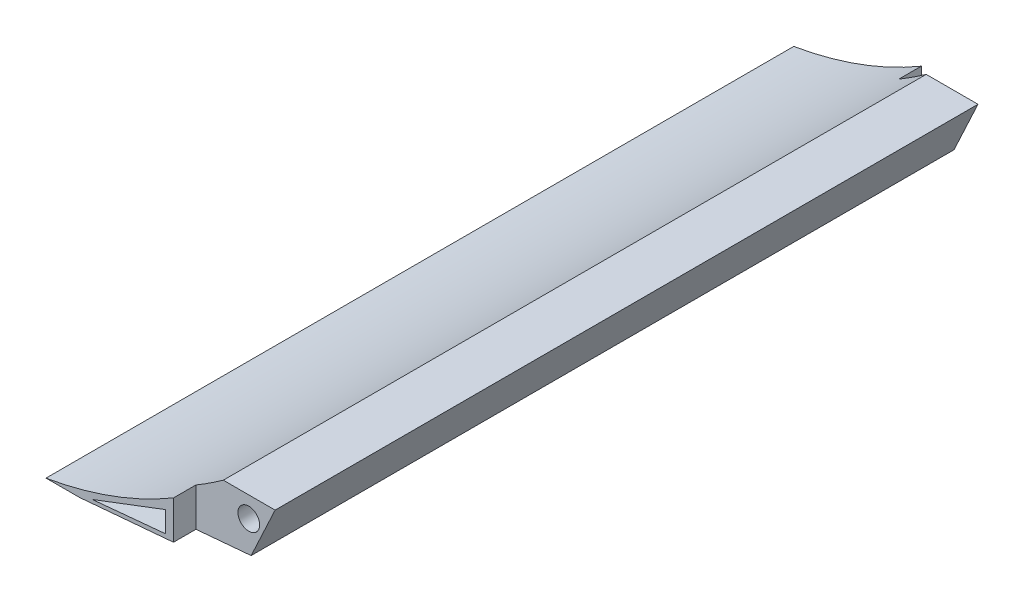
ISO-10303-21;
HEADER;
FILE_DESCRIPTION(('STEP AP214'),'2;1');
FILE_NAME('part.step','',(''),(''),'','','');
FILE_SCHEMA(('AUTOMOTIVE_DESIGN { 1 0 10303 214 1 1 1 1 }'));
ENDSEC;
DATA;
#1=APPLICATION_CONTEXT('core data for automotive mechanical design processes');
#2=APPLICATION_PROTOCOL_DEFINITION('international standard','automotive_design',2000,#1);
#3=PRODUCT_CONTEXT('',#1,'mechanical');
#4=PRODUCT('Part','Part','',(#3));
#5=PRODUCT_RELATED_PRODUCT_CATEGORY('part','',(#4));
#6=PRODUCT_DEFINITION_FORMATION('','',#4);
#7=PRODUCT_DEFINITION_CONTEXT('part definition',#1,'design');
#8=PRODUCT_DEFINITION('design','',#6,#7);
#9=PRODUCT_DEFINITION_SHAPE('','',#8);
#10=(LENGTH_UNIT() NAMED_UNIT(*) SI_UNIT(.MILLI.,.METRE.));
#11=(NAMED_UNIT(*) PLANE_ANGLE_UNIT() SI_UNIT($,.RADIAN.));
#12=(NAMED_UNIT(*) SI_UNIT($,.STERADIAN.) SOLID_ANGLE_UNIT());
#13=UNCERTAINTY_MEASURE_WITH_UNIT(LENGTH_MEASURE(1.E-05),#10,'distance_accuracy_value','');
#14=(GEOMETRIC_REPRESENTATION_CONTEXT(3) GLOBAL_UNCERTAINTY_ASSIGNED_CONTEXT((#13)) GLOBAL_UNIT_ASSIGNED_CONTEXT((#10,
#11,#12)) REPRESENTATION_CONTEXT('',''));
#15=CARTESIAN_POINT('',(0.,0.,0.));
#16=DIRECTION('',(0.,0.,1.));
#17=DIRECTION('',(1.,0.,0.));
#18=AXIS2_PLACEMENT_3D('',#15,#16,#17);
#19=CARTESIAN_POINT('',(28.8056094575249,8.61689614419259,0.));
#20=DIRECTION('',(0.,-1.,0.));
#21=DIRECTION('',(1.,0.,0.));
#22=AXIS2_PLACEMENT_3D('',#19,#20,#21);
#23=PLANE('',#22);
#24=DIRECTION('',(-1.,0.,0.));
#25=VECTOR('',#24,1.);
#26=CARTESIAN_POINT('',(17.0541951466913,8.61689614419259,3.));
#27=LINE('',#26,#25);
#28=CARTESIAN_POINT('',(27.6398403121374,8.61689614419259,3.));
#29=VERTEX_POINT('',#28);
#30=CARTESIAN_POINT('',(20.7110042655877,8.61689614419258,3.));
#31=VERTEX_POINT('',#30);
#32=EDGE_CURVE('E47',#29,#31,#27,.T.);
#33=ORIENTED_EDGE('',*,*,#32,.T.);
#34=DIRECTION('',(0.,0.,-1.));
#35=VECTOR('',#34,1.);
#36=CARTESIAN_POINT('',(20.7110042655877,8.61689614419258,100.));
#37=LINE('',#36,#35);
#38=CARTESIAN_POINT('',(20.7110042655877,8.61689614419259,97.));
#39=VERTEX_POINT('',#38);
#40=EDGE_CURVE('E181',#39,#31,#37,.T.);
#41=ORIENTED_EDGE('',*,*,#40,.F.);
#42=DIRECTION('',(1.,0.,0.));
#43=VECTOR('',#42,1.);
#44=CARTESIAN_POINT('',(17.0541951466913,8.61689614419259,97.));
#45=LINE('',#44,#43);
#46=CARTESIAN_POINT('',(27.6398403121374,8.61689614419259,97.));
#47=VERTEX_POINT('',#46);
#48=EDGE_CURVE('E172',#39,#47,#45,.T.);
#49=ORIENTED_EDGE('',*,*,#48,.T.);
#50=DIRECTION('',(0.,0.,1.));
#51=VECTOR('',#50,1.);
#52=CARTESIAN_POINT('',(27.6398403121374,8.61689614419259,100.));
#53=LINE('',#52,#51);
#54=EDGE_CURVE('E179',#29,#47,#53,.T.);
#55=ORIENTED_EDGE('',*,*,#54,.F.);
#56=EDGE_LOOP('',(#33,#41,#49,#55));
#57=FACE_BOUND('',#56,.T.);
#58=ADVANCED_FACE('F32',(#57),#23,.F.);
#59=CARTESIAN_POINT('',(24.4345434564826,1.74311485495317,100.));
#60=DIRECTION('',(-0.906307787036651,0.422618261740697,0.));
#61=DIRECTION('',(-0.422618261740697,-0.906307787036651,0.));
#62=AXIS2_PLACEMENT_3D('',#59,#60,#61);
#63=PLANE('',#62);
#64=DIRECTION('',(-0.422618261740697,-0.906307787036651,0.));
#65=VECTOR('',#64,1.);
#66=CARTESIAN_POINT('',(24.4345434564826,1.74311485495317,3.));
#67=LINE('',#66,#65);
#68=CARTESIAN_POINT('',(24.4345434564826,1.74311485495317,3.));
#69=VERTEX_POINT('',#68);
#70=EDGE_CURVE('E11',#29,#69,#67,.T.);
#71=ORIENTED_EDGE('',*,*,#70,.F.);
#72=ORIENTED_EDGE('',*,*,#54,.T.);
#73=DIRECTION('',(0.422618261740697,0.906307787036651,0.));
#74=VECTOR('',#73,1.);
#75=CARTESIAN_POINT('',(24.4345434564826,1.74311485495317,97.));
#76=LINE('',#75,#74);
#77=CARTESIAN_POINT('',(24.4345434564826,1.74311485495317,97.));
#78=VERTEX_POINT('',#77);
#79=EDGE_CURVE('E40',#78,#47,#76,.T.);
#80=ORIENTED_EDGE('',*,*,#79,.F.);
#81=DIRECTION('',(0.,0.,-1.));
#82=VECTOR('',#81,1.);
#83=CARTESIAN_POINT('',(24.4345434564826,1.74311485495317,100.));
#84=LINE('',#83,#82);
#85=EDGE_CURVE('E160',#78,#69,#84,.T.);
#86=ORIENTED_EDGE('',*,*,#85,.T.);
#87=EDGE_LOOP('',(#71,#72,#80,#86));
#88=FACE_BOUND('',#87,.T.);
#89=ADVANCED_FACE('F184',(#88),#63,.F.);
#90=CARTESIAN_POINT('',(-8.36169175325331,49.2958630213893,0.));
#91=DIRECTION('',(0.,0.,1.));
#92=DIRECTION('',(1.,0.,0.));
#93=AXIS2_PLACEMENT_3D('',#90,#91,#92);
#94=PLANE('',#93);
#95=DIRECTION('',(0.,1.,0.));
#96=VECTOR('',#95,1.);
#97=CARTESIAN_POINT('',(17.0541951466913,8.61689614419259,0.));
#98=LINE('',#97,#96);
#99=CARTESIAN_POINT('',(17.0541951466913,1.09741804497372,0.));
#100=VERTEX_POINT('',#99);
#101=CARTESIAN_POINT('',(17.0541951466913,6.23738310059758,0.));
#102=VERTEX_POINT('',#101);
#103=EDGE_CURVE('E127',#100,#102,#98,.T.);
#104=ORIENTED_EDGE('',*,*,#103,.F.);
#105=DIRECTION('',(0.996194698091746,0.0871557427476583,0.));
#106=VECTOR('',#105,1.);
#107=CARTESIAN_POINT('',(4.51064949464766,0.,0.));
#108=LINE('',#107,#106);
#109=CARTESIAN_POINT('',(4.51064949464766,0.,0.));
#110=VERTEX_POINT('',#109);
#111=EDGE_CURVE('E132',#110,#100,#108,.T.);
#112=ORIENTED_EDGE('',*,*,#111,.F.);
#113=DIRECTION('',(1.,0.,0.));
#114=VECTOR('',#113,1.);
#115=CARTESIAN_POINT('',(0.,0.,0.));
#116=LINE('',#115,#114);
#117=CARTESIAN_POINT('',(0.,0.,0.));
#118=VERTEX_POINT('',#117);
#119=EDGE_CURVE('E153',#118,#110,#116,.T.);
#120=ORIENTED_EDGE('',*,*,#119,.F.);
#121=CARTESIAN_POINT('',(-8.36169175325331,49.2958630213893,0.));
#122=DIRECTION('',(0.,0.,-1.));
#123=DIRECTION('',(1.,0.,0.));
#124=AXIS2_PLACEMENT_3D('',#121,#122,#123);
#125=CIRCLE('',#124,50.);
#126=EDGE_CURVE('E133',#102,#118,#125,.T.);
#127=ORIENTED_EDGE('',*,*,#126,.F.);
#128=EDGE_LOOP('',(#104,#112,#120,#127));
#129=FACE_BOUND('',#128,.T.);
#130=ADVANCED_FACE('F129',(#129),#94,.F.);
#131=CARTESIAN_POINT('',(-8.36169175325331,49.2958630213893,100.));
#132=DIRECTION('',(0.,0.,-1.));
#133=DIRECTION('',(-1.,0.,0.));
#134=AXIS2_PLACEMENT_3D('',#131,#132,#133);
#135=CYLINDRICAL_SURFACE('',#134,50.);
#136=CARTESIAN_POINT('',(-8.36169175325331,49.2958630213893,3.));
#137=DIRECTION('',(0.,0.,-1.));
#138=DIRECTION('',(-1.,0.,0.));
#139=AXIS2_PLACEMENT_3D('',#136,#137,#138);
#140=CIRCLE('',#139,50.);
#141=CARTESIAN_POINT('',(17.0541951466913,6.23738310059758,3.));
#142=VERTEX_POINT('',#141);
#143=EDGE_CURVE('E443',#142,#31,#140,.F.);
#144=ORIENTED_EDGE('',*,*,#143,.F.);
#145=DIRECTION('',(0.,0.,-1.));
#146=VECTOR('',#145,1.);
#147=CARTESIAN_POINT('',(17.0541951466913,6.23738310059758,100.));
#148=LINE('',#147,#146);
#149=EDGE_CURVE('E209',#142,#102,#148,.T.);
#150=ORIENTED_EDGE('',*,*,#149,.T.);
#151=ORIENTED_EDGE('',*,*,#126,.T.);
#152=DIRECTION('',(0.,0.,-1.));
#153=VECTOR('',#152,1.);
#154=CARTESIAN_POINT('',(0.,0.,100.));
#155=LINE('',#154,#153);
#156=CARTESIAN_POINT('',(0.,0.,100.));
#157=VERTEX_POINT('',#156);
#158=EDGE_CURVE('E165',#157,#118,#155,.T.);
#159=ORIENTED_EDGE('',*,*,#158,.F.);
#160=CARTESIAN_POINT('',(-8.36169175325331,49.2958630213893,100.));
#161=DIRECTION('',(0.,0.,-1.));
#162=DIRECTION('',(1.,0.,0.));
#163=AXIS2_PLACEMENT_3D('',#160,#161,#162);
#164=CIRCLE('',#163,50.);
#165=CARTESIAN_POINT('',(17.0541951466913,6.23738310059758,100.));
#166=VERTEX_POINT('',#165);
#167=EDGE_CURVE('E152',#166,#157,#164,.T.);
#168=ORIENTED_EDGE('',*,*,#167,.F.);
#169=DIRECTION('',(0.,0.,-1.));
#170=VECTOR('',#169,1.);
#171=CARTESIAN_POINT('',(17.0541951466913,6.23738310059758,100.));
#172=LINE('',#171,#170);
#173=CARTESIAN_POINT('',(17.0541951466913,6.23738310059758,97.));
#174=VERTEX_POINT('',#173);
#175=EDGE_CURVE('E219',#166,#174,#172,.T.);
#176=ORIENTED_EDGE('',*,*,#175,.T.);
#177=CARTESIAN_POINT('',(-8.36169175325331,49.2958630213893,97.));
#178=DIRECTION('',(0.,0.,-1.));
#179=DIRECTION('',(-1.,0.,0.));
#180=AXIS2_PLACEMENT_3D('',#177,#178,#179);
#181=CIRCLE('',#180,50.);
#182=EDGE_CURVE('E220',#174,#39,#181,.F.);
#183=ORIENTED_EDGE('',*,*,#182,.T.);
#184=ORIENTED_EDGE('',*,*,#40,.T.);
#185=EDGE_LOOP('',(#144,#150,#151,#159,#168,#176,#183,#184));
#186=FACE_BOUND('',#185,.T.);
#187=ADVANCED_FACE('F34',(#186),#135,.F.);
#188=CARTESIAN_POINT('',(0.,0.,100.));
#189=DIRECTION('',(0.,1.,0.));
#190=DIRECTION('',(-1.,0.,0.));
#191=AXIS2_PLACEMENT_3D('',#188,#189,#190);
#192=PLANE('',#191);
#193=ORIENTED_EDGE('',*,*,#119,.T.);
#194=DIRECTION('',(0.,0.,-1.));
#195=VECTOR('',#194,1.);
#196=CARTESIAN_POINT('',(4.51064949464766,0.,100.));
#197=LINE('',#196,#195);
#198=CARTESIAN_POINT('',(4.51064949464766,0.,100.));
#199=VERTEX_POINT('',#198);
#200=EDGE_CURVE('E151',#199,#110,#197,.T.);
#201=ORIENTED_EDGE('',*,*,#200,.F.);
#202=DIRECTION('',(1.,0.,0.));
#203=VECTOR('',#202,1.);
#204=CARTESIAN_POINT('',(0.,0.,100.));
#205=LINE('',#204,#203);
#206=EDGE_CURVE('E155',#157,#199,#205,.T.);
#207=ORIENTED_EDGE('',*,*,#206,.F.);
#208=ORIENTED_EDGE('',*,*,#158,.T.);
#209=EDGE_LOOP('',(#193,#201,#207,#208));
#210=FACE_BOUND('',#209,.T.);
#211=ADVANCED_FACE('F212',(#210),#192,.F.);
#212=CARTESIAN_POINT('',(4.51064949464766,0.,100.));
#213=DIRECTION('',(-0.0871557427476583,0.996194698091746,0.));
#214=DIRECTION('',(-0.996194698091746,-0.0871557427476583,0.));
#215=AXIS2_PLACEMENT_3D('',#212,#213,#214);
#216=PLANE('',#215);
#217=ORIENTED_EDGE('',*,*,#111,.T.);
#218=DIRECTION('',(0.,0.,1.));
#219=VECTOR('',#218,1.);
#220=CARTESIAN_POINT('',(17.0541951466913,1.09741804497372,100.));
#221=LINE('',#220,#219);
#222=CARTESIAN_POINT('',(17.0541951466913,1.09741804497372,3.));
#223=VERTEX_POINT('',#222);
#224=EDGE_CURVE('E137',#100,#223,#221,.T.);
#225=ORIENTED_EDGE('',*,*,#224,.T.);
#226=DIRECTION('',(0.996194698091746,0.0871557427476583,0.));
#227=VECTOR('',#226,1.);
#228=CARTESIAN_POINT('',(4.51064949464766,0.,3.));
#229=LINE('',#228,#227);
#230=EDGE_CURVE('E145',#223,#69,#229,.T.);
#231=ORIENTED_EDGE('',*,*,#230,.T.);
#232=ORIENTED_EDGE('',*,*,#85,.F.);
#233=DIRECTION('',(0.996194698091746,0.0871557427476583,0.));
#234=VECTOR('',#233,1.);
#235=CARTESIAN_POINT('',(4.51064949464766,0.,97.));
#236=LINE('',#235,#234);
#237=CARTESIAN_POINT('',(17.0541951466913,1.09741804497372,97.));
#238=VERTEX_POINT('',#237);
#239=EDGE_CURVE('E175',#238,#78,#236,.T.);
#240=ORIENTED_EDGE('',*,*,#239,.F.);
#241=DIRECTION('',(0.,0.,1.));
#242=VECTOR('',#241,1.);
#243=CARTESIAN_POINT('',(17.0541951466913,1.09741804497372,100.));
#244=LINE('',#243,#242);
#245=CARTESIAN_POINT('',(17.0541951466913,1.09741804497372,100.));
#246=VERTEX_POINT('',#245);
#247=EDGE_CURVE('E437',#238,#246,#244,.T.);
#248=ORIENTED_EDGE('',*,*,#247,.T.);
#249=DIRECTION('',(0.996194698091746,0.0871557427476583,0.));
#250=VECTOR('',#249,1.);
#251=CARTESIAN_POINT('',(4.51064949464766,0.,100.));
#252=LINE('',#251,#250);
#253=EDGE_CURVE('E163',#199,#246,#252,.T.);
#254=ORIENTED_EDGE('',*,*,#253,.F.);
#255=ORIENTED_EDGE('',*,*,#200,.T.);
#256=EDGE_LOOP('',(#217,#225,#231,#232,#240,#248,#254,#255));
#257=FACE_BOUND('',#256,.T.);
#258=ADVANCED_FACE('F148',(#257),#216,.F.);
#259=CARTESIAN_POINT('',(-8.36169175325331,49.2958630213893,100.));
#260=DIRECTION('',(0.,0.,1.));
#261=DIRECTION('',(1.,0.,0.));
#262=AXIS2_PLACEMENT_3D('',#259,#260,#261);
#263=PLANE('',#262);
#264=ORIENTED_EDGE('',*,*,#253,.T.);
#265=DIRECTION('',(0.,-1.,0.));
#266=VECTOR('',#265,1.);
#267=CARTESIAN_POINT('',(17.0541951466913,3.07196219291131,100.));
#268=LINE('',#267,#266);
#269=EDGE_CURVE('E217',#166,#246,#268,.T.);
#270=ORIENTED_EDGE('',*,*,#269,.F.);
#271=ORIENTED_EDGE('',*,*,#167,.T.);
#272=ORIENTED_EDGE('',*,*,#206,.T.);
#273=EDGE_LOOP('',(#264,#270,#271,#272));
#274=FACE_BOUND('',#273,.T.);
#275=DIRECTION('',(0.995555735114542,0.0941741911594838,0.));
#276=VECTOR('',#275,1.);
#277=CARTESIAN_POINT('',(15.9485289272431,1.54366350893075,100.));
#278=LINE('',#277,#276);
#279=CARTESIAN_POINT('',(6.18702488017592,0.62027799096494,100.));
#280=VERTEX_POINT('',#279);
#281=CARTESIAN_POINT('',(15.9485289272431,1.54366350893075,100.));
#282=VERTEX_POINT('',#281);
#283=EDGE_CURVE('E55',#280,#282,#278,.T.);
#284=ORIENTED_EDGE('',*,*,#283,.F.);
#285=DIRECTION('',(-0.934755488328412,-0.355291678821659,0.));
#286=VECTOR('',#285,1.);
#287=CARTESIAN_POINT('',(6.18702488017592,0.62027799096494,100.));
#288=LINE('',#287,#286);
#289=CARTESIAN_POINT('',(15.9485289272431,4.33053292288187,100.));
#290=VERTEX_POINT('',#289);
#291=EDGE_CURVE('E234',#290,#280,#288,.T.);
#292=ORIENTED_EDGE('',*,*,#291,.F.);
#293=DIRECTION('',(0.,1.,0.));
#294=VECTOR('',#293,1.);
#295=CARTESIAN_POINT('',(15.9485289272431,4.33053292288187,100.));
#296=LINE('',#295,#294);
#297=EDGE_CURVE('E224',#282,#290,#296,.T.);
#298=ORIENTED_EDGE('',*,*,#297,.F.);
#299=EDGE_LOOP('',(#284,#292,#298));
#300=FACE_BOUND('',#299,.T.);
#301=ADVANCED_FACE('F214',(#274,#300),#263,.T.);
#302=CARTESIAN_POINT('',(17.0541951466913,3.07196219291131,97.));
#303=DIRECTION('',(0.,0.,1.));
#304=DIRECTION('',(1.,0.,0.));
#305=AXIS2_PLACEMENT_3D('',#302,#303,#304);
#306=PLANE('',#305);
#307=DIRECTION('',(0.,-1.,0.));
#308=VECTOR('',#307,1.);
#309=CARTESIAN_POINT('',(17.0541951466913,3.07196219291131,97.));
#310=LINE('',#309,#308);
#311=EDGE_CURVE('E226',#174,#238,#310,.T.);
#312=ORIENTED_EDGE('',*,*,#311,.T.);
#313=ORIENTED_EDGE('',*,*,#239,.T.);
#314=ORIENTED_EDGE('',*,*,#79,.T.);
#315=ORIENTED_EDGE('',*,*,#48,.F.);
#316=ORIENTED_EDGE('',*,*,#182,.F.);
#317=EDGE_LOOP('',(#312,#313,#314,#315,#316));
#318=FACE_BOUND('',#317,.T.);
#319=CARTESIAN_POINT('',(24.1200764570038,5.86405569460841,97.));
#320=DIRECTION('',(0.,0.,1.));
#321=DIRECTION('',(1.,0.,0.));
#322=AXIS2_PLACEMENT_3D('',#319,#320,#321);
#323=CIRCLE('',#322,1.44999999999999);
#324=CARTESIAN_POINT('',(25.5700764570037,5.86405569460841,97.));
#325=VERTEX_POINT('',#324);
#326=EDGE_CURVE('E197',#325,#325,#323,.T.);
#327=ORIENTED_EDGE('',*,*,#326,.F.);
#328=EDGE_LOOP('',(#327));
#329=FACE_BOUND('',#328,.T.);
#330=ADVANCED_FACE('F170',(#318,#329),#306,.T.);
#331=CARTESIAN_POINT('',(17.0541951466913,3.07196219291131,3.));
#332=DIRECTION('',(0.,0.,-1.));
#333=DIRECTION('',(1.,0.,0.));
#334=AXIS2_PLACEMENT_3D('',#331,#332,#333);
#335=PLANE('',#334);
#336=ORIENTED_EDGE('',*,*,#70,.T.);
#337=ORIENTED_EDGE('',*,*,#230,.F.);
#338=DIRECTION('',(0.,1.,0.));
#339=VECTOR('',#338,1.);
#340=CARTESIAN_POINT('',(17.0541951466913,8.61689614419259,3.));
#341=LINE('',#340,#339);
#342=EDGE_CURVE('E136',#223,#142,#341,.T.);
#343=ORIENTED_EDGE('',*,*,#342,.T.);
#344=ORIENTED_EDGE('',*,*,#143,.T.);
#345=ORIENTED_EDGE('',*,*,#32,.F.);
#346=EDGE_LOOP('',(#336,#337,#343,#344,#345));
#347=FACE_BOUND('',#346,.T.);
#348=CARTESIAN_POINT('',(24.1200764570038,5.86405569460841,3.));
#349=DIRECTION('',(0.,0.,-1.));
#350=DIRECTION('',(-1.,0.,0.));
#351=AXIS2_PLACEMENT_3D('',#348,#349,#350);
#352=CIRCLE('',#351,1.44999999999999);
#353=CARTESIAN_POINT('',(22.6700764570038,5.86405569460841,3.));
#354=VERTEX_POINT('',#353);
#355=EDGE_CURVE('E191',#354,#354,#352,.T.);
#356=ORIENTED_EDGE('',*,*,#355,.F.);
#357=EDGE_LOOP('',(#356));
#358=FACE_BOUND('',#357,.T.);
#359=ADVANCED_FACE('F288',(#347,#358),#335,.T.);
#360=CARTESIAN_POINT('',(24.1200764570038,5.86405569460841,81.));
#361=DIRECTION('',(0.,0.,1.));
#362=DIRECTION('',(1.,0.,0.));
#363=AXIS2_PLACEMENT_3D('',#360,#361,#362);
#364=CONICAL_SURFACE('',#363,1.45,1.02974425867665);
#365=CARTESIAN_POINT('',(24.1200764570037,5.86405569460841,80.12875210241));
#366=VERTEX_POINT('',#365);
#367=VERTEX_LOOP('',#366);
#368=FACE_BOUND('',#367,.T.);
#369=CARTESIAN_POINT('',(24.1200764570038,5.86405569460841,81.));
#370=DIRECTION('',(0.,0.,1.));
#371=DIRECTION('',(1.,0.,0.));
#372=AXIS2_PLACEMENT_3D('',#369,#370,#371);
#373=CIRCLE('',#372,1.45);
#374=CARTESIAN_POINT('',(25.5700764570037,5.86405569460841,81.));
#375=VERTEX_POINT('',#374);
#376=EDGE_CURVE('E200',#375,#375,#373,.T.);
#377=ORIENTED_EDGE('',*,*,#376,.T.);
#378=EDGE_LOOP('',(#377));
#379=FACE_BOUND('',#378,.T.);
#380=ADVANCED_FACE('F284',(#368,#379),#364,.F.);
#381=CARTESIAN_POINT('',(24.1200764570038,5.86405569460841,97.));
#382=DIRECTION('',(0.,0.,1.));
#383=DIRECTION('',(1.,0.,0.));
#384=AXIS2_PLACEMENT_3D('',#381,#382,#383);
#385=CYLINDRICAL_SURFACE('',#384,1.44999999999999);
#386=ORIENTED_EDGE('',*,*,#376,.F.);
#387=EDGE_LOOP('',(#386));
#388=FACE_BOUND('',#387,.T.);
#389=ORIENTED_EDGE('',*,*,#326,.T.);
#390=EDGE_LOOP('',(#389));
#391=FACE_BOUND('',#390,.T.);
#392=ADVANCED_FACE('F280',(#388,#391),#385,.F.);
#393=CARTESIAN_POINT('',(24.1200764570038,5.86405569460841,19.));
#394=DIRECTION('',(0.,0.,-1.));
#395=DIRECTION('',(-1.,0.,0.));
#396=AXIS2_PLACEMENT_3D('',#393,#394,#395);
#397=CONICAL_SURFACE('',#396,1.45,1.02974425867665);
#398=CARTESIAN_POINT('',(24.1200764570037,5.86405569460841,19.87124789759));
#399=VERTEX_POINT('',#398);
#400=VERTEX_LOOP('',#399);
#401=FACE_BOUND('',#400,.T.);
#402=CARTESIAN_POINT('',(24.1200764570038,5.86405569460841,19.));
#403=DIRECTION('',(0.,0.,-1.));
#404=DIRECTION('',(-1.,0.,0.));
#405=AXIS2_PLACEMENT_3D('',#402,#403,#404);
#406=CIRCLE('',#405,1.45);
#407=CARTESIAN_POINT('',(22.6700764570038,5.86405569460841,19.));
#408=VERTEX_POINT('',#407);
#409=EDGE_CURVE('E194',#408,#408,#406,.T.);
#410=ORIENTED_EDGE('',*,*,#409,.T.);
#411=EDGE_LOOP('',(#410));
#412=FACE_BOUND('',#411,.T.);
#413=ADVANCED_FACE('F267',(#401,#412),#397,.F.);
#414=CARTESIAN_POINT('',(24.1200764570038,5.86405569460841,3.));
#415=DIRECTION('',(0.,0.,-1.));
#416=DIRECTION('',(-1.,0.,0.));
#417=AXIS2_PLACEMENT_3D('',#414,#415,#416);
#418=CYLINDRICAL_SURFACE('',#417,1.44999999999999);
#419=ORIENTED_EDGE('',*,*,#409,.F.);
#420=EDGE_LOOP('',(#419));
#421=FACE_BOUND('',#420,.T.);
#422=ORIENTED_EDGE('',*,*,#355,.T.);
#423=EDGE_LOOP('',(#422));
#424=FACE_BOUND('',#423,.T.);
#425=ADVANCED_FACE('F260',(#421,#424),#418,.F.);
#426=CARTESIAN_POINT('',(15.9485289272431,1.54366350893075,2.));
#427=DIRECTION('',(0.0941741911594838,-0.995555735114542,0.));
#428=DIRECTION('',(0.995555735114543,0.0941741911594838,0.));
#429=AXIS2_PLACEMENT_3D('',#426,#427,#428);
#430=PLANE('',#429);
#431=ORIENTED_EDGE('',*,*,#283,.T.);
#432=DIRECTION('',(0.,0.,1.));
#433=VECTOR('',#432,1.);
#434=CARTESIAN_POINT('',(15.9485289272431,1.54366350893075,2.));
#435=LINE('',#434,#433);
#436=CARTESIAN_POINT('',(15.9485289272431,1.54366350893075,2.));
#437=VERTEX_POINT('',#436);
#438=EDGE_CURVE('E239',#437,#282,#435,.T.);
#439=ORIENTED_EDGE('',*,*,#438,.F.);
#440=DIRECTION('',(0.995555735114542,0.0941741911594838,0.));
#441=VECTOR('',#440,1.);
#442=CARTESIAN_POINT('',(15.9485289272431,1.54366350893075,2.));
#443=LINE('',#442,#441);
#444=CARTESIAN_POINT('',(6.18702488017592,0.62027799096494,2.));
#445=VERTEX_POINT('',#444);
#446=EDGE_CURVE('E230',#445,#437,#443,.T.);
#447=ORIENTED_EDGE('',*,*,#446,.F.);
#448=DIRECTION('',(0.,0.,1.));
#449=VECTOR('',#448,1.);
#450=CARTESIAN_POINT('',(6.18702488017592,0.62027799096494,2.));
#451=LINE('',#450,#449);
#452=EDGE_CURVE('E186',#445,#280,#451,.T.);
#453=ORIENTED_EDGE('',*,*,#452,.T.);
#454=EDGE_LOOP('',(#431,#439,#447,#453));
#455=FACE_BOUND('',#454,.T.);
#456=ADVANCED_FACE('F258',(#455),#430,.F.);
#457=CARTESIAN_POINT('',(6.18702488017592,0.62027799096494,2.));
#458=DIRECTION('',(-0.355291678821659,0.934755488328412,0.));
#459=DIRECTION('',(-0.934755488328412,-0.355291678821659,0.));
#460=AXIS2_PLACEMENT_3D('',#457,#458,#459);
#461=PLANE('',#460);
#462=ORIENTED_EDGE('',*,*,#291,.T.);
#463=ORIENTED_EDGE('',*,*,#452,.F.);
#464=DIRECTION('',(-0.934755488328412,-0.355291678821659,0.));
#465=VECTOR('',#464,1.);
#466=CARTESIAN_POINT('',(6.18702488017592,0.62027799096494,2.));
#467=LINE('',#466,#465);
#468=CARTESIAN_POINT('',(15.9485289272431,4.33053292288187,2.));
#469=VERTEX_POINT('',#468);
#470=EDGE_CURVE('E237',#469,#445,#467,.T.);
#471=ORIENTED_EDGE('',*,*,#470,.F.);
#472=DIRECTION('',(0.,0.,1.));
#473=VECTOR('',#472,1.);
#474=CARTESIAN_POINT('',(15.9485289272431,4.33053292288187,2.));
#475=LINE('',#474,#473);
#476=EDGE_CURVE('E246',#469,#290,#475,.T.);
#477=ORIENTED_EDGE('',*,*,#476,.T.);
#478=EDGE_LOOP('',(#462,#463,#471,#477));
#479=FACE_BOUND('',#478,.T.);
#480=ADVANCED_FACE('F254',(#479),#461,.F.);
#481=CARTESIAN_POINT('',(15.9485289272431,4.33053292288187,2.));
#482=DIRECTION('',(1.,0.,0.));
#483=DIRECTION('',(0.,0.,-1.));
#484=AXIS2_PLACEMENT_3D('',#481,#482,#483);
#485=PLANE('',#484);
#486=ORIENTED_EDGE('',*,*,#297,.T.);
#487=ORIENTED_EDGE('',*,*,#476,.F.);
#488=DIRECTION('',(0.,1.,0.));
#489=VECTOR('',#488,1.);
#490=CARTESIAN_POINT('',(15.9485289272431,4.33053292288187,2.));
#491=LINE('',#490,#489);
#492=EDGE_CURVE('E233',#437,#469,#491,.T.);
#493=ORIENTED_EDGE('',*,*,#492,.F.);
#494=ORIENTED_EDGE('',*,*,#438,.T.);
#495=EDGE_LOOP('',(#486,#487,#493,#494));
#496=FACE_BOUND('',#495,.T.);
#497=ADVANCED_FACE('F250',(#496),#485,.F.);
#498=CARTESIAN_POINT('',(0.,0.,2.));
#499=DIRECTION('',(0.,0.,1.));
#500=DIRECTION('',(1.,0.,0.));
#501=AXIS2_PLACEMENT_3D('',#498,#499,#500);
#502=PLANE('',#501);
#503=ORIENTED_EDGE('',*,*,#446,.T.);
#504=ORIENTED_EDGE('',*,*,#492,.T.);
#505=ORIENTED_EDGE('',*,*,#470,.T.);
#506=EDGE_LOOP('',(#503,#504,#505));
#507=FACE_BOUND('',#506,.T.);
#508=ADVANCED_FACE('F257',(#507),#502,.T.);
#509=CARTESIAN_POINT('',(17.0541951466913,3.07196219291131,97.));
#510=DIRECTION('',(-1.,0.,0.));
#511=DIRECTION('',(0.,0.,1.));
#512=AXIS2_PLACEMENT_3D('',#509,#510,#511);
#513=PLANE('',#512);
#514=ORIENTED_EDGE('',*,*,#269,.T.);
#515=ORIENTED_EDGE('',*,*,#247,.F.);
#516=ORIENTED_EDGE('',*,*,#311,.F.);
#517=ORIENTED_EDGE('',*,*,#175,.F.);
#518=EDGE_LOOP('',(#514,#515,#516,#517));
#519=FACE_BOUND('',#518,.T.);
#520=ADVANCED_FACE('F380',(#519),#513,.F.);
#521=CARTESIAN_POINT('',(17.0541951466913,8.61689614419259,3.));
#522=DIRECTION('',(-1.,0.,0.));
#523=DIRECTION('',(0.,0.,1.));
#524=AXIS2_PLACEMENT_3D('',#521,#522,#523);
#525=PLANE('',#524);
#526=ORIENTED_EDGE('',*,*,#342,.F.);
#527=ORIENTED_EDGE('',*,*,#224,.F.);
#528=ORIENTED_EDGE('',*,*,#103,.T.);
#529=ORIENTED_EDGE('',*,*,#149,.F.);
#530=EDGE_LOOP('',(#526,#527,#528,#529));
#531=FACE_BOUND('',#530,.T.);
#532=ADVANCED_FACE('F140',(#531),#525,.F.);
#533=CLOSED_SHELL('',(#58,#89,#130,#187,#211,#258,#301,#330,#359,#380,#392,#413,#425,#456,#480,
#497,#508,#520,#532));
#534=MANIFOLD_SOLID_BREP('B2',#533);
#535=ADVANCED_BREP_SHAPE_REPRESENTATION('',(#18,#534),#14);
#536=SHAPE_DEFINITION_REPRESENTATION(#9,#535);
ENDSEC;
END-ISO-10303-21;
